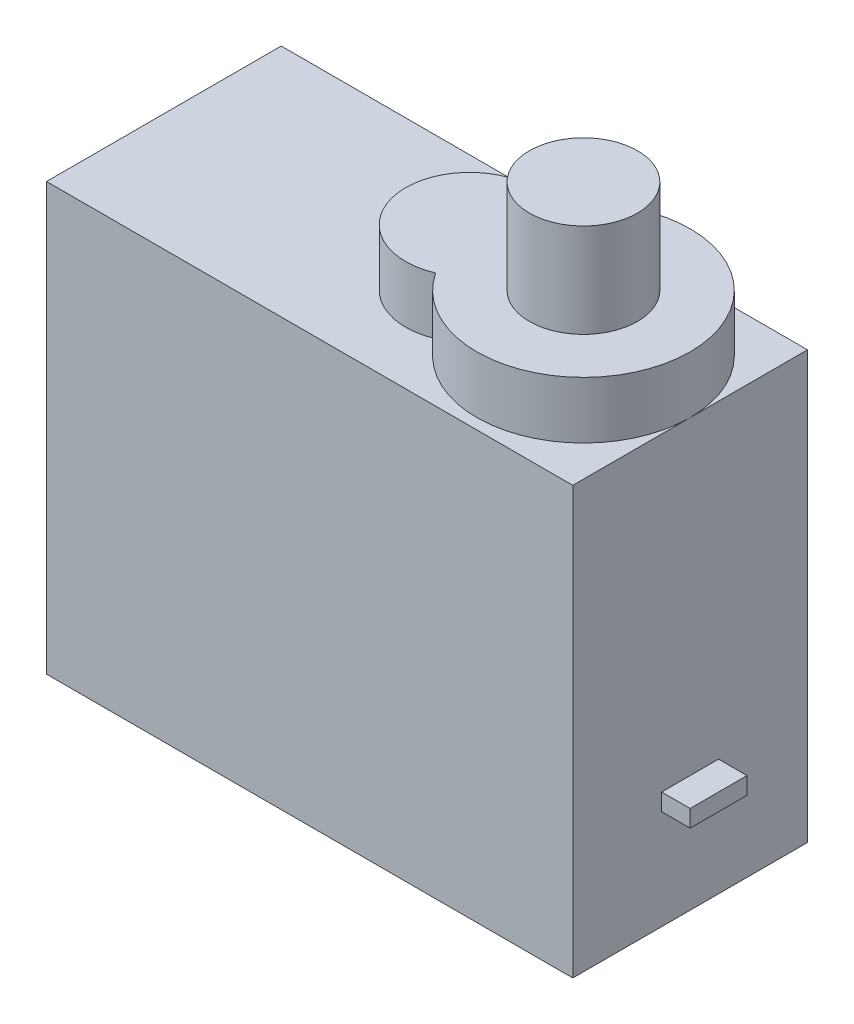
ISO-10303-21;
HEADER;
FILE_DESCRIPTION(('STEP AP214'),'2;1');
FILE_NAME('part.step','',(''),(''),'','','');
FILE_SCHEMA(('AUTOMOTIVE_DESIGN { 1 0 10303 214 1 1 1 1 }'));
ENDSEC;
DATA;
#1=APPLICATION_CONTEXT('core data for automotive mechanical design processes');
#2=APPLICATION_PROTOCOL_DEFINITION('international standard','automotive_design',2000,#1);
#3=PRODUCT_CONTEXT('',#1,'mechanical');
#4=PRODUCT('Part','Part','',(#3));
#5=PRODUCT_RELATED_PRODUCT_CATEGORY('part','',(#4));
#6=PRODUCT_DEFINITION_FORMATION('','',#4);
#7=PRODUCT_DEFINITION_CONTEXT('part definition',#1,'design');
#8=PRODUCT_DEFINITION('design','',#6,#7);
#9=PRODUCT_DEFINITION_SHAPE('','',#8);
#10=(LENGTH_UNIT() NAMED_UNIT(*) SI_UNIT(.MILLI.,.METRE.));
#11=(NAMED_UNIT(*) PLANE_ANGLE_UNIT() SI_UNIT($,.RADIAN.));
#12=(NAMED_UNIT(*) SI_UNIT($,.STERADIAN.) SOLID_ANGLE_UNIT());
#13=UNCERTAINTY_MEASURE_WITH_UNIT(LENGTH_MEASURE(1.E-05),#10,'distance_accuracy_value','');
#14=(GEOMETRIC_REPRESENTATION_CONTEXT(3) GLOBAL_UNCERTAINTY_ASSIGNED_CONTEXT((#13)) GLOBAL_UNIT_ASSIGNED_CONTEXT((#10,
#11,#12)) REPRESENTATION_CONTEXT('',''));
#15=CARTESIAN_POINT('',(0.,0.,0.));
#16=DIRECTION('',(0.,0.,1.));
#17=DIRECTION('',(1.,0.,0.));
#18=AXIS2_PLACEMENT_3D('',#15,#16,#17);
#19=CARTESIAN_POINT('',(9.25,15.,4.125));
#20=DIRECTION('',(-1.,0.,0.));
#21=DIRECTION('',(0.,0.,1.));
#22=AXIS2_PLACEMENT_3D('',#19,#20,#21);
#23=PLANE('',#22);
#24=DIRECTION('',(0.,0.,-1.));
#25=VECTOR('',#24,1.);
#26=CARTESIAN_POINT('',(9.25,0.,4.125));
#27=LINE('',#26,#25);
#28=CARTESIAN_POINT('',(9.25,0.,4.125));
#29=VERTEX_POINT('',#28);
#30=CARTESIAN_POINT('',(9.25,0.,-4.125));
#31=VERTEX_POINT('',#30);
#32=EDGE_CURVE('E180',#29,#31,#27,.T.);
#33=ORIENTED_EDGE('',*,*,#32,.T.);
#34=DIRECTION('',(0.,-1.,0.));
#35=VECTOR('',#34,1.);
#36=CARTESIAN_POINT('',(9.25,15.,-4.125));
#37=LINE('',#36,#35);
#38=CARTESIAN_POINT('',(9.25,15.,-4.125));
#39=VERTEX_POINT('',#38);
#40=EDGE_CURVE('E185',#39,#31,#37,.T.);
#41=ORIENTED_EDGE('',*,*,#40,.F.);
#42=DIRECTION('',(0.,0.,-1.));
#43=VECTOR('',#42,1.);
#44=CARTESIAN_POINT('',(9.25,15.,4.125));
#45=LINE('',#44,#43);
#46=CARTESIAN_POINT('',(9.24999999999999,15.,0.));
#47=VERTEX_POINT('',#46);
#48=EDGE_CURVE('E169',#47,#39,#45,.T.);
#49=ORIENTED_EDGE('',*,*,#48,.F.);
#50=CARTESIAN_POINT('',(9.25,15.,4.125));
#51=VERTEX_POINT('',#50);
#52=EDGE_CURVE('E170',#51,#47,#45,.T.);
#53=ORIENTED_EDGE('',*,*,#52,.F.);
#54=DIRECTION('',(0.,-1.,0.));
#55=VECTOR('',#54,1.);
#56=CARTESIAN_POINT('',(9.25,15.,4.125));
#57=LINE('',#56,#55);
#58=EDGE_CURVE('E187',#51,#29,#57,.T.);
#59=ORIENTED_EDGE('',*,*,#58,.T.);
#60=EDGE_LOOP('',(#33,#41,#49,#53,#59));
#61=FACE_BOUND('',#60,.T.);
#62=DIRECTION('',(0.,-1.,0.));
#63=VECTOR('',#62,1.);
#64=CARTESIAN_POINT('',(9.25,3.5,1.));
#65=LINE('',#64,#63);
#66=CARTESIAN_POINT('',(9.25,4.1,1.));
#67=VERTEX_POINT('',#66);
#68=CARTESIAN_POINT('',(9.25,3.5,1.));
#69=VERTEX_POINT('',#68);
#70=EDGE_CURVE('E137',#67,#69,#65,.T.);
#71=ORIENTED_EDGE('',*,*,#70,.F.);
#72=DIRECTION('',(0.,0.,1.));
#73=VECTOR('',#72,1.);
#74=CARTESIAN_POINT('',(9.25,4.1,-1.));
#75=LINE('',#74,#73);
#76=CARTESIAN_POINT('',(9.25,4.1,-1.));
#77=VERTEX_POINT('',#76);
#78=EDGE_CURVE('E134',#77,#67,#75,.T.);
#79=ORIENTED_EDGE('',*,*,#78,.F.);
#80=DIRECTION('',(0.,1.,0.));
#81=VECTOR('',#80,1.);
#82=CARTESIAN_POINT('',(9.25,3.5,-1.));
#83=LINE('',#82,#81);
#84=CARTESIAN_POINT('',(9.25,3.5,-1.));
#85=VERTEX_POINT('',#84);
#86=EDGE_CURVE('E57',#85,#77,#83,.T.);
#87=ORIENTED_EDGE('',*,*,#86,.F.);
#88=DIRECTION('',(0.,0.,-1.));
#89=VECTOR('',#88,1.);
#90=CARTESIAN_POINT('',(9.25,3.5,-1.));
#91=LINE('',#90,#89);
#92=EDGE_CURVE('E52',#69,#85,#91,.T.);
#93=ORIENTED_EDGE('',*,*,#92,.F.);
#94=EDGE_LOOP('',(#71,#79,#87,#93));
#95=FACE_BOUND('',#94,.T.);
#96=ADVANCED_FACE('F36',(#61,#95),#23,.F.);
#97=CARTESIAN_POINT('',(5.49999999999999,17.,0.));
#98=DIRECTION('',(0.,-1.,0.));
#99=DIRECTION('',(0.,0.,-1.));
#100=AXIS2_PLACEMENT_3D('',#97,#98,#99);
#101=CYLINDRICAL_SURFACE('',#100,3.75);
#102=DIRECTION('',(0.,-1.,0.));
#103=VECTOR('',#102,1.);
#104=CARTESIAN_POINT('',(2.37499999999999,16.,-2.07289049397213));
#105=LINE('',#104,#103);
#106=CARTESIAN_POINT('',(2.37499999999999,17.,-2.07289049397212));
#107=VERTEX_POINT('',#106);
#108=CARTESIAN_POINT('',(2.37499999999999,15.,-2.07289049397212));
#109=VERTEX_POINT('',#108);
#110=EDGE_CURVE('E153',#107,#109,#105,.T.);
#111=ORIENTED_EDGE('',*,*,#110,.F.);
#112=CARTESIAN_POINT('',(5.49999999999999,17.,0.));
#113=DIRECTION('',(0.,1.,0.));
#114=DIRECTION('',(0.,0.,1.));
#115=AXIS2_PLACEMENT_3D('',#112,#113,#114);
#116=CIRCLE('',#115,3.75);
#117=CARTESIAN_POINT('',(2.37499999999999,17.,2.07289049397212));
#118=VERTEX_POINT('',#117);
#119=EDGE_CURVE('E156',#118,#107,#116,.T.);
#120=ORIENTED_EDGE('',*,*,#119,.F.);
#121=DIRECTION('',(0.,-1.,0.));
#122=VECTOR('',#121,1.);
#123=CARTESIAN_POINT('',(2.37499999999999,16.,2.07289049397213));
#124=LINE('',#123,#122);
#125=CARTESIAN_POINT('',(2.37499999999999,15.,2.07289049397212));
#126=VERTEX_POINT('',#125);
#127=EDGE_CURVE('E149',#126,#118,#124,.F.);
#128=ORIENTED_EDGE('',*,*,#127,.F.);
#129=CARTESIAN_POINT('',(5.49999999999999,15.,0.));
#130=DIRECTION('',(0.,1.,0.));
#131=DIRECTION('',(0.,0.,1.));
#132=AXIS2_PLACEMENT_3D('',#129,#130,#131);
#133=CIRCLE('',#132,3.75);
#134=EDGE_CURVE('E155',#126,#47,#133,.T.);
#135=ORIENTED_EDGE('',*,*,#134,.T.);
#136=EDGE_CURVE('E160',#47,#109,#133,.T.);
#137=ORIENTED_EDGE('',*,*,#136,.T.);
#138=EDGE_LOOP('',(#111,#120,#128,#135,#137));
#139=FACE_BOUND('',#138,.T.);
#140=ADVANCED_FACE('F217',(#139),#101,.T.);
#141=CARTESIAN_POINT('',(-9.25,15.,4.125));
#142=DIRECTION('',(1.,0.,0.));
#143=DIRECTION('',(0.,0.,-1.));
#144=AXIS2_PLACEMENT_3D('',#141,#142,#143);
#145=PLANE('',#144);
#146=DIRECTION('',(0.,0.,1.));
#147=VECTOR('',#146,1.);
#148=CARTESIAN_POINT('',(-9.25,0.,4.125));
#149=LINE('',#148,#147);
#150=CARTESIAN_POINT('',(-9.25,0.,-4.125));
#151=VERTEX_POINT('',#150);
#152=CARTESIAN_POINT('',(-9.25,0.,4.125));
#153=VERTEX_POINT('',#152);
#154=EDGE_CURVE('E159',#151,#153,#149,.T.);
#155=ORIENTED_EDGE('',*,*,#154,.T.);
#156=DIRECTION('',(0.,-1.,0.));
#157=VECTOR('',#156,1.);
#158=CARTESIAN_POINT('',(-9.25,15.,4.125));
#159=LINE('',#158,#157);
#160=CARTESIAN_POINT('',(-9.25,15.,4.125));
#161=VERTEX_POINT('',#160);
#162=EDGE_CURVE('E40',#161,#153,#159,.T.);
#163=ORIENTED_EDGE('',*,*,#162,.F.);
#164=DIRECTION('',(0.,0.,1.));
#165=VECTOR('',#164,1.);
#166=CARTESIAN_POINT('',(-9.25,15.,4.125));
#167=LINE('',#166,#165);
#168=CARTESIAN_POINT('',(-9.25,15.,-4.125));
#169=VERTEX_POINT('',#168);
#170=EDGE_CURVE('E163',#169,#161,#167,.T.);
#171=ORIENTED_EDGE('',*,*,#170,.F.);
#172=DIRECTION('',(0.,-1.,0.));
#173=VECTOR('',#172,1.);
#174=CARTESIAN_POINT('',(-9.25,15.,-4.125));
#175=LINE('',#174,#173);
#176=EDGE_CURVE('E175',#169,#151,#175,.T.);
#177=ORIENTED_EDGE('',*,*,#176,.T.);
#178=EDGE_LOOP('',(#155,#163,#171,#177));
#179=FACE_BOUND('',#178,.T.);
#180=ADVANCED_FACE('F38',(#179),#145,.F.);
#181=CARTESIAN_POINT('',(9.25,15.,4.125));
#182=DIRECTION('',(0.,0.,-1.));
#183=DIRECTION('',(-1.,0.,0.));
#184=AXIS2_PLACEMENT_3D('',#181,#182,#183);
#185=PLANE('',#184);
#186=DIRECTION('',(1.,0.,0.));
#187=VECTOR('',#186,1.);
#188=CARTESIAN_POINT('',(9.25,0.,4.125));
#189=LINE('',#188,#187);
#190=EDGE_CURVE('E178',#153,#29,#189,.T.);
#191=ORIENTED_EDGE('',*,*,#190,.T.);
#192=ORIENTED_EDGE('',*,*,#58,.F.);
#193=DIRECTION('',(1.,0.,0.));
#194=VECTOR('',#193,1.);
#195=CARTESIAN_POINT('',(9.25,15.,4.125));
#196=LINE('',#195,#194);
#197=EDGE_CURVE('E166',#161,#51,#196,.T.);
#198=ORIENTED_EDGE('',*,*,#197,.F.);
#199=ORIENTED_EDGE('',*,*,#162,.T.);
#200=EDGE_LOOP('',(#191,#192,#198,#199));
#201=FACE_BOUND('',#200,.T.);
#202=ADVANCED_FACE('F196',(#201),#185,.F.);
#203=CARTESIAN_POINT('',(9.25,15.,-4.125));
#204=DIRECTION('',(0.,0.,1.));
#205=DIRECTION('',(1.,0.,0.));
#206=AXIS2_PLACEMENT_3D('',#203,#204,#205);
#207=PLANE('',#206);
#208=DIRECTION('',(-1.,0.,0.));
#209=VECTOR('',#208,1.);
#210=CARTESIAN_POINT('',(9.25,0.,-4.125));
#211=LINE('',#210,#209);
#212=EDGE_CURVE('E167',#31,#151,#211,.T.);
#213=ORIENTED_EDGE('',*,*,#212,.T.);
#214=ORIENTED_EDGE('',*,*,#176,.F.);
#215=DIRECTION('',(-1.,0.,0.));
#216=VECTOR('',#215,1.);
#217=CARTESIAN_POINT('',(9.25,15.,-4.125));
#218=LINE('',#217,#216);
#219=EDGE_CURVE('E173',#39,#169,#218,.T.);
#220=ORIENTED_EDGE('',*,*,#219,.F.);
#221=ORIENTED_EDGE('',*,*,#40,.T.);
#222=EDGE_LOOP('',(#213,#214,#220,#221));
#223=FACE_BOUND('',#222,.T.);
#224=ADVANCED_FACE('F208',(#223),#207,.F.);
#225=CARTESIAN_POINT('',(0.,15.,0.));
#226=DIRECTION('',(0.,1.,0.));
#227=DIRECTION('',(0.,0.,1.));
#228=AXIS2_PLACEMENT_3D('',#225,#226,#227);
#229=PLANE('',#228);
#230=ORIENTED_EDGE('',*,*,#134,.F.);
#231=CARTESIAN_POINT('',(1.49999999999999,15.,0.));
#232=DIRECTION('',(0.,1.,0.));
#233=DIRECTION('',(0.,0.,1.));
#234=AXIS2_PLACEMENT_3D('',#231,#232,#233);
#235=CIRCLE('',#234,2.25);
#236=EDGE_CURVE('E141',#109,#126,#235,.T.);
#237=ORIENTED_EDGE('',*,*,#236,.F.);
#238=ORIENTED_EDGE('',*,*,#136,.F.);
#239=ORIENTED_EDGE('',*,*,#48,.T.);
#240=ORIENTED_EDGE('',*,*,#219,.T.);
#241=ORIENTED_EDGE('',*,*,#170,.T.);
#242=ORIENTED_EDGE('',*,*,#197,.T.);
#243=ORIENTED_EDGE('',*,*,#52,.T.);
#244=EDGE_LOOP('',(#230,#237,#238,#239,#240,#241,#242,#243));
#245=FACE_BOUND('',#244,.T.);
#246=ADVANCED_FACE('F211',(#245),#229,.T.);
#247=CARTESIAN_POINT('',(0.,0.,0.));
#248=DIRECTION('',(0.,1.,0.));
#249=DIRECTION('',(0.,0.,1.));
#250=AXIS2_PLACEMENT_3D('',#247,#248,#249);
#251=PLANE('',#250);
#252=ORIENTED_EDGE('',*,*,#154,.F.);
#253=ORIENTED_EDGE('',*,*,#212,.F.);
#254=ORIENTED_EDGE('',*,*,#32,.F.);
#255=ORIENTED_EDGE('',*,*,#190,.F.);
#256=EDGE_LOOP('',(#252,#253,#254,#255));
#257=FACE_BOUND('',#256,.T.);
#258=ADVANCED_FACE('F203',(#257),#251,.F.);
#259=CARTESIAN_POINT('',(5.49999999999999,17.,0.));
#260=DIRECTION('',(0.,1.,0.));
#261=DIRECTION('',(0.,0.,1.));
#262=AXIS2_PLACEMENT_3D('',#259,#260,#261);
#263=PLANE('',#262);
#264=CARTESIAN_POINT('',(5.49999999999999,17.,0.));
#265=DIRECTION('',(0.,1.,0.));
#266=DIRECTION('',(0.,0.,1.));
#267=AXIS2_PLACEMENT_3D('',#264,#265,#266);
#268=CIRCLE('',#267,1.9);
#269=CARTESIAN_POINT('',(5.49999999999999,17.,1.9));
#270=VERTEX_POINT('',#269);
#271=EDGE_CURVE('E11',#270,#270,#268,.T.);
#272=ORIENTED_EDGE('',*,*,#271,.F.);
#273=EDGE_LOOP('',(#272));
#274=FACE_BOUND('',#273,.T.);
#275=ORIENTED_EDGE('',*,*,#119,.T.);
#276=CARTESIAN_POINT('',(1.49999999999999,17.,0.));
#277=DIRECTION('',(0.,1.,0.));
#278=DIRECTION('',(0.,0.,1.));
#279=AXIS2_PLACEMENT_3D('',#276,#277,#278);
#280=CIRCLE('',#279,2.25);
#281=EDGE_CURVE('E147',#107,#118,#280,.T.);
#282=ORIENTED_EDGE('',*,*,#281,.T.);
#283=EDGE_LOOP('',(#275,#282));
#284=FACE_BOUND('',#283,.T.);
#285=ADVANCED_FACE('F222',(#274,#284),#263,.T.);
#286=CARTESIAN_POINT('',(1.49999999999999,17.,0.));
#287=DIRECTION('',(0.,-1.,0.));
#288=DIRECTION('',(0.,0.,-1.));
#289=AXIS2_PLACEMENT_3D('',#286,#287,#288);
#290=CYLINDRICAL_SURFACE('',#289,2.25);
#291=ORIENTED_EDGE('',*,*,#281,.F.);
#292=ORIENTED_EDGE('',*,*,#110,.T.);
#293=ORIENTED_EDGE('',*,*,#236,.T.);
#294=ORIENTED_EDGE('',*,*,#127,.T.);
#295=EDGE_LOOP('',(#291,#292,#293,#294));
#296=FACE_BOUND('',#295,.T.);
#297=ADVANCED_FACE('F220',(#296),#290,.T.);
#298=CARTESIAN_POINT('',(5.49999999999999,20.3,0.));
#299=DIRECTION('',(0.,-1.,0.));
#300=DIRECTION('',(0.,0.,-1.));
#301=AXIS2_PLACEMENT_3D('',#298,#299,#300);
#302=CYLINDRICAL_SURFACE('',#301,1.9);
#303=CARTESIAN_POINT('',(5.49999999999999,20.3,0.));
#304=DIRECTION('',(0.,1.,0.));
#305=DIRECTION('',(0.,0.,1.));
#306=AXIS2_PLACEMENT_3D('',#303,#304,#305);
#307=CIRCLE('',#306,1.9);
#308=CARTESIAN_POINT('',(5.49999999999999,20.3,1.9));
#309=VERTEX_POINT('',#308);
#310=EDGE_CURVE('E138',#309,#309,#307,.T.);
#311=ORIENTED_EDGE('',*,*,#310,.F.);
#312=EDGE_LOOP('',(#311));
#313=FACE_BOUND('',#312,.T.);
#314=ORIENTED_EDGE('',*,*,#271,.T.);
#315=EDGE_LOOP('',(#314));
#316=FACE_BOUND('',#315,.T.);
#317=ADVANCED_FACE('F230',(#313,#316),#302,.T.);
#318=CARTESIAN_POINT('',(5.49999999999999,20.3,0.));
#319=DIRECTION('',(0.,1.,0.));
#320=DIRECTION('',(0.,0.,1.));
#321=AXIS2_PLACEMENT_3D('',#318,#319,#320);
#322=PLANE('',#321);
#323=ORIENTED_EDGE('',*,*,#310,.T.);
#324=EDGE_LOOP('',(#323));
#325=FACE_BOUND('',#324,.T.);
#326=ADVANCED_FACE('F285',(#325),#322,.T.);
#327=CARTESIAN_POINT('',(10.25,3.5,1.));
#328=DIRECTION('',(0.,0.,-1.));
#329=DIRECTION('',(-1.,0.,0.));
#330=AXIS2_PLACEMENT_3D('',#327,#328,#329);
#331=PLANE('',#330);
#332=ORIENTED_EDGE('',*,*,#70,.T.);
#333=DIRECTION('',(-1.,0.,0.));
#334=VECTOR('',#333,1.);
#335=CARTESIAN_POINT('',(10.25,3.5,1.));
#336=LINE('',#335,#334);
#337=CARTESIAN_POINT('',(10.25,3.5,1.));
#338=VERTEX_POINT('',#337);
#339=EDGE_CURVE('E118',#338,#69,#336,.T.);
#340=ORIENTED_EDGE('',*,*,#339,.F.);
#341=DIRECTION('',(0.,-1.,0.));
#342=VECTOR('',#341,1.);
#343=CARTESIAN_POINT('',(10.25,3.5,1.));
#344=LINE('',#343,#342);
#345=CARTESIAN_POINT('',(10.25,4.1,1.));
#346=VERTEX_POINT('',#345);
#347=EDGE_CURVE('E125',#346,#338,#344,.T.);
#348=ORIENTED_EDGE('',*,*,#347,.F.);
#349=DIRECTION('',(-1.,0.,0.));
#350=VECTOR('',#349,1.);
#351=CARTESIAN_POINT('',(10.25,4.1,1.));
#352=LINE('',#351,#350);
#353=EDGE_CURVE('E349',#346,#67,#352,.T.);
#354=ORIENTED_EDGE('',*,*,#353,.T.);
#355=EDGE_LOOP('',(#332,#340,#348,#354));
#356=FACE_BOUND('',#355,.T.);
#357=ADVANCED_FACE('F136',(#356),#331,.F.);
#358=CARTESIAN_POINT('',(10.25,3.5,-1.));
#359=DIRECTION('',(0.,1.,0.));
#360=DIRECTION('',(0.,0.,1.));
#361=AXIS2_PLACEMENT_3D('',#358,#359,#360);
#362=PLANE('',#361);
#363=ORIENTED_EDGE('',*,*,#92,.T.);
#364=DIRECTION('',(-1.,0.,0.));
#365=VECTOR('',#364,1.);
#366=CARTESIAN_POINT('',(10.25,3.5,-1.));
#367=LINE('',#366,#365);
#368=CARTESIAN_POINT('',(10.25,3.5,-1.));
#369=VERTEX_POINT('',#368);
#370=EDGE_CURVE('E121',#369,#85,#367,.T.);
#371=ORIENTED_EDGE('',*,*,#370,.F.);
#372=DIRECTION('',(0.,0.,-1.));
#373=VECTOR('',#372,1.);
#374=CARTESIAN_POINT('',(10.25,3.5,-1.));
#375=LINE('',#374,#373);
#376=EDGE_CURVE('E114',#338,#369,#375,.T.);
#377=ORIENTED_EDGE('',*,*,#376,.F.);
#378=ORIENTED_EDGE('',*,*,#339,.T.);
#379=EDGE_LOOP('',(#363,#371,#377,#378));
#380=FACE_BOUND('',#379,.T.);
#381=ADVANCED_FACE('F116',(#380),#362,.F.);
#382=CARTESIAN_POINT('',(10.25,3.5,-1.));
#383=DIRECTION('',(0.,0.,1.));
#384=DIRECTION('',(1.,0.,0.));
#385=AXIS2_PLACEMENT_3D('',#382,#383,#384);
#386=PLANE('',#385);
#387=ORIENTED_EDGE('',*,*,#86,.T.);
#388=DIRECTION('',(-1.,0.,0.));
#389=VECTOR('',#388,1.);
#390=CARTESIAN_POINT('',(10.25,4.1,-1.));
#391=LINE('',#390,#389);
#392=CARTESIAN_POINT('',(10.25,4.1,-1.));
#393=VERTEX_POINT('',#392);
#394=EDGE_CURVE('E143',#393,#77,#391,.T.);
#395=ORIENTED_EDGE('',*,*,#394,.F.);
#396=DIRECTION('',(0.,1.,0.));
#397=VECTOR('',#396,1.);
#398=CARTESIAN_POINT('',(10.25,3.5,-1.));
#399=LINE('',#398,#397);
#400=EDGE_CURVE('E124',#369,#393,#399,.T.);
#401=ORIENTED_EDGE('',*,*,#400,.F.);
#402=ORIENTED_EDGE('',*,*,#370,.T.);
#403=EDGE_LOOP('',(#387,#395,#401,#402));
#404=FACE_BOUND('',#403,.T.);
#405=ADVANCED_FACE('F316',(#404),#386,.F.);
#406=CARTESIAN_POINT('',(10.25,4.1,-1.));
#407=DIRECTION('',(0.,-1.,0.));
#408=DIRECTION('',(0.,0.,-1.));
#409=AXIS2_PLACEMENT_3D('',#406,#407,#408);
#410=PLANE('',#409);
#411=ORIENTED_EDGE('',*,*,#78,.T.);
#412=ORIENTED_EDGE('',*,*,#353,.F.);
#413=DIRECTION('',(0.,0.,1.));
#414=VECTOR('',#413,1.);
#415=CARTESIAN_POINT('',(10.25,4.1,-1.));
#416=LINE('',#415,#414);
#417=EDGE_CURVE('E130',#393,#346,#416,.T.);
#418=ORIENTED_EDGE('',*,*,#417,.F.);
#419=ORIENTED_EDGE('',*,*,#394,.T.);
#420=EDGE_LOOP('',(#411,#412,#418,#419));
#421=FACE_BOUND('',#420,.T.);
#422=ADVANCED_FACE('F325',(#421),#410,.F.);
#423=CARTESIAN_POINT('',(10.25,0.,0.));
#424=DIRECTION('',(1.,0.,0.));
#425=DIRECTION('',(0.,0.,-1.));
#426=AXIS2_PLACEMENT_3D('',#423,#424,#425);
#427=PLANE('',#426);
#428=ORIENTED_EDGE('',*,*,#347,.T.);
#429=ORIENTED_EDGE('',*,*,#376,.T.);
#430=ORIENTED_EDGE('',*,*,#400,.T.);
#431=ORIENTED_EDGE('',*,*,#417,.T.);
#432=EDGE_LOOP('',(#428,#429,#430,#431));
#433=FACE_BOUND('',#432,.T.);
#434=ADVANCED_FACE('F128',(#433),#427,.T.);
#435=CLOSED_SHELL('',(#96,#140,#180,#202,#224,#246,#258,#285,#297,#317,#326,#357,#381,#405,#422,#434));
#436=MANIFOLD_SOLID_BREP('B2',#435);
#437=ADVANCED_BREP_SHAPE_REPRESENTATION('',(#18,#436),#14);
#438=SHAPE_DEFINITION_REPRESENTATION(#9,#437);
ENDSEC;
END-ISO-10303-21;
